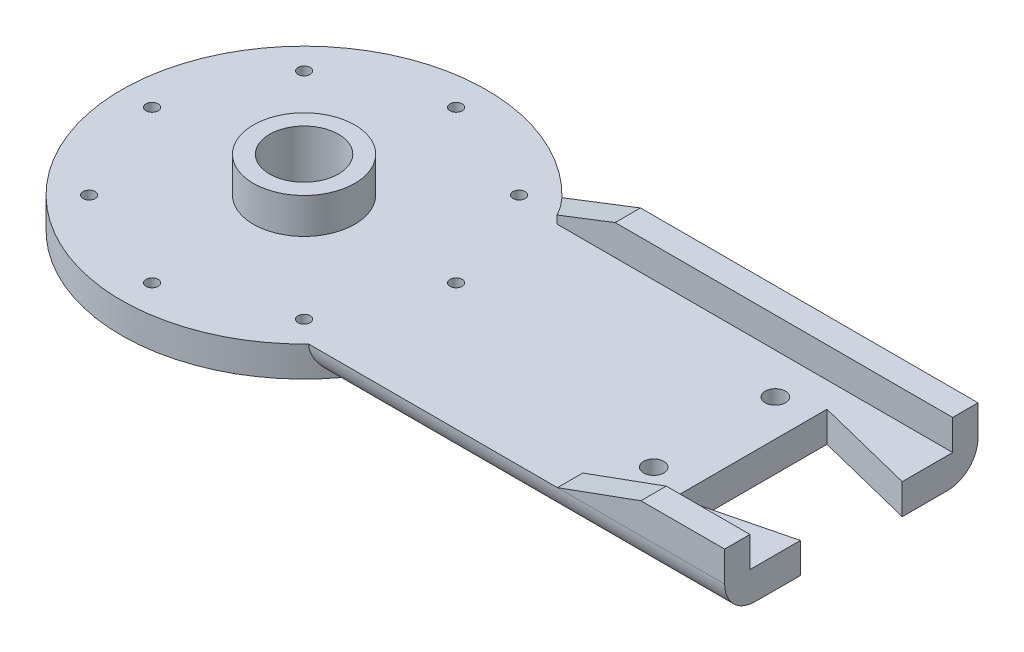
ISO-10303-21;
HEADER;
FILE_DESCRIPTION(('STEP AP214'),'2;1');
FILE_NAME('part.step','',(''),(''),'','','');
FILE_SCHEMA(('AUTOMOTIVE_DESIGN { 1 0 10303 214 1 1 1 1 }'));
ENDSEC;
DATA;
#1=APPLICATION_CONTEXT('core data for automotive mechanical design processes');
#2=APPLICATION_PROTOCOL_DEFINITION('international standard','automotive_design',2000,#1);
#3=PRODUCT_CONTEXT('',#1,'mechanical');
#4=PRODUCT('Part','Part','',(#3));
#5=PRODUCT_RELATED_PRODUCT_CATEGORY('part','',(#4));
#6=PRODUCT_DEFINITION_FORMATION('','',#4);
#7=PRODUCT_DEFINITION_CONTEXT('part definition',#1,'design');
#8=PRODUCT_DEFINITION('design','',#6,#7);
#9=PRODUCT_DEFINITION_SHAPE('','',#8);
#10=(LENGTH_UNIT() NAMED_UNIT(*) SI_UNIT(.MILLI.,.METRE.));
#11=(NAMED_UNIT(*) PLANE_ANGLE_UNIT() SI_UNIT($,.RADIAN.));
#12=(NAMED_UNIT(*) SI_UNIT($,.STERADIAN.) SOLID_ANGLE_UNIT());
#13=UNCERTAINTY_MEASURE_WITH_UNIT(LENGTH_MEASURE(1.E-05),#10,'distance_accuracy_value','');
#14=(GEOMETRIC_REPRESENTATION_CONTEXT(3) GLOBAL_UNCERTAINTY_ASSIGNED_CONTEXT((#13)) GLOBAL_UNIT_ASSIGNED_CONTEXT((#10,
#11,#12)) REPRESENTATION_CONTEXT('',''));
#15=CARTESIAN_POINT('',(0.,0.,0.));
#16=DIRECTION('',(0.,0.,1.));
#17=DIRECTION('',(1.,0.,0.));
#18=AXIS2_PLACEMENT_3D('',#15,#16,#17);
#19=CARTESIAN_POINT('',(-17.2583060351027,3.,-0.123865495102666));
#20=DIRECTION('',(0.,1.,0.));
#21=DIRECTION('',(0.,0.,1.));
#22=AXIS2_PLACEMENT_3D('',#19,#20,#21);
#23=PLANE('',#22);
#24=DIRECTION('',(0.,0.,1.));
#25=VECTOR('',#24,1.);
#26=CARTESIAN_POINT('',(20.2464685723943,3.,12.3719246819812));
#27=LINE('',#26,#25);
#28=CARTESIAN_POINT('',(20.2464685723943,3.,9.87192468198121));
#29=VERTEX_POINT('',#28);
#30=CARTESIAN_POINT('',(20.2464685723943,3.,12.3719246819812));
#31=VERTEX_POINT('',#30);
#32=EDGE_CURVE('E343',#29,#31,#27,.T.);
#33=ORIENTED_EDGE('',*,*,#32,.F.);
#34=DIRECTION('',(-1.,0.,0.));
#35=VECTOR('',#34,1.);
#36=CARTESIAN_POINT('',(36.7464685723943,3.,9.8719246819812));
#37=LINE('',#36,#35);
#38=CARTESIAN_POINT('',(36.7464685723943,3.,9.8719246819812));
#39=VERTEX_POINT('',#38);
#40=EDGE_CURVE('E352',#39,#29,#37,.T.);
#41=ORIENTED_EDGE('',*,*,#40,.F.);
#42=DIRECTION('',(0.,0.,-1.));
#43=VECTOR('',#42,1.);
#44=CARTESIAN_POINT('',(36.7464685723943,3.,4.8969247773482));
#45=LINE('',#44,#43);
#46=CARTESIAN_POINT('',(36.7464685723943,3.,4.8969247773482));
#47=VERTEX_POINT('',#46);
#48=EDGE_CURVE('E215',#39,#47,#45,.T.);
#49=ORIENTED_EDGE('',*,*,#48,.T.);
#50=DIRECTION('',(-0.970142511139978,0.,0.242535581057745));
#51=VECTOR('',#50,1.);
#52=CARTESIAN_POINT('',(36.7464685723943,3.,4.8969247773482));
#53=LINE('',#52,#51);
#54=CARTESIAN_POINT('',(26.8464670465143,3.,7.3719246819812));
#55=VERTEX_POINT('',#54);
#56=EDGE_CURVE('E223',#47,#55,#53,.T.);
#57=ORIENTED_EDGE('',*,*,#56,.T.);
#58=DIRECTION('',(0.,0.,-1.));
#59=VECTOR('',#58,1.);
#60=CARTESIAN_POINT('',(26.8464670465143,3.,7.3719246819812));
#61=LINE('',#60,#59);
#62=CARTESIAN_POINT('',(26.8464670465143,3.,-7.6280753180188));
#63=VERTEX_POINT('',#62);
#64=EDGE_CURVE('E226',#55,#63,#61,.T.);
#65=ORIENTED_EDGE('',*,*,#64,.T.);
#66=DIRECTION('',(0.970142511139978,0.,0.242535581057745));
#67=VECTOR('',#66,1.);
#68=CARTESIAN_POINT('',(26.8464670465143,3.,-7.6280753180188));
#69=LINE('',#68,#67);
#70=CARTESIAN_POINT('',(36.7464685723943,3.,-5.1530754133858));
#71=VERTEX_POINT('',#70);
#72=EDGE_CURVE('E217',#63,#71,#69,.T.);
#73=ORIENTED_EDGE('',*,*,#72,.T.);
#74=DIRECTION('',(0.,0.,-1.));
#75=VECTOR('',#74,1.);
#76=CARTESIAN_POINT('',(36.7464685723943,3.,-5.1530754133858));
#77=LINE('',#76,#75);
#78=CARTESIAN_POINT('',(36.7464685723943,3.,-10.1280753180188));
#79=VERTEX_POINT('',#78);
#80=EDGE_CURVE('E211',#71,#79,#77,.T.);
#81=ORIENTED_EDGE('',*,*,#80,.T.);
#82=DIRECTION('',(1.,0.,0.));
#83=VECTOR('',#82,1.);
#84=CARTESIAN_POINT('',(36.7464685723943,3.,-10.1280753180188));
#85=LINE('',#84,#83);
#86=CARTESIAN_POINT('',(-2.29241331476712,3.,-10.1280753180188));
#87=VERTEX_POINT('',#86);
#88=EDGE_CURVE('E203',#87,#79,#85,.T.);
#89=ORIENTED_EDGE('',*,*,#88,.F.);
#90=CARTESIAN_POINT('',(-17.2535313024667,3.,-0.128075480997254));
#91=DIRECTION('',(0.,-1.,0.));
#92=DIRECTION('',(0.,0.,1.));
#93=AXIS2_PLACEMENT_3D('',#90,#91,#92);
#94=CIRCLE('',#93,17.9954174217299);
#95=CARTESIAN_POINT('',(-4.30806675859033,3.,-12.6280753180188));
#96=VERTEX_POINT('',#95);
#97=EDGE_CURVE('E189',#96,#87,#94,.T.);
#98=ORIENTED_EDGE('',*,*,#97,.F.);
#99=CARTESIAN_POINT('',(-17.2583060351027,3.,-0.123865495102666));
#100=DIRECTION('',(0.,1.,0.));
#101=DIRECTION('',(0.,0.,1.));
#102=AXIS2_PLACEMENT_3D('',#99,#100,#101);
#103=CIRCLE('',#102,18.0017765960595);
#104=CARTESIAN_POINT('',(-4.29994238590957,3.,12.3719246819812));
#105=VERTEX_POINT('',#104);
#106=EDGE_CURVE('E200',#96,#105,#103,.T.);
#107=ORIENTED_EDGE('',*,*,#106,.T.);
#108=DIRECTION('',(1.,0.,0.));
#109=VECTOR('',#108,1.);
#110=CARTESIAN_POINT('',(36.7464685723943,3.,12.3719246819812));
#111=LINE('',#110,#109);
#112=EDGE_CURVE('E210',#105,#31,#111,.T.);
#113=ORIENTED_EDGE('',*,*,#112,.T.);
#114=EDGE_LOOP('',(#33,#41,#49,#57,#65,#73,#81,#89,#98,#107,#113));
#115=FACE_BOUND('',#114,.T.);
#116=CARTESIAN_POINT('',(-32.2535312150286,3.,-0.128075069628852));
#117=DIRECTION('',(0.,1.,0.));
#118=DIRECTION('',(0.,0.,1.));
#119=AXIS2_PLACEMENT_3D('',#116,#117,#118);
#120=CIRCLE('',#119,0.599999637650936);
#121=CARTESIAN_POINT('',(-32.2535312150286,3.,0.471924568022084));
#122=VERTEX_POINT('',#121);
#123=EDGE_CURVE('E392',#122,#122,#120,.T.);
#124=ORIENTED_EDGE('',*,*,#123,.F.);
#125=EDGE_LOOP('',(#124));
#126=FACE_BOUND('',#125,.T.);
#127=CARTESIAN_POINT('',(-17.2535311792144,3.,14.8719244694054));
#128=DIRECTION('',(0.,1.,0.));
#129=DIRECTION('',(0.,0.,1.));
#130=AXIS2_PLACEMENT_3D('',#127,#128,#129);
#131=CIRCLE('',#130,0.599999637649657);
#132=CARTESIAN_POINT('',(-17.2535311792144,3.,15.471924107055));
#133=VERTEX_POINT('',#132);
#134=EDGE_CURVE('E408',#133,#133,#131,.T.);
#135=ORIENTED_EDGE('',*,*,#134,.F.);
#136=EDGE_LOOP('',(#135));
#137=FACE_BOUND('',#136,.T.);
#138=CARTESIAN_POINT('',(-2.2535316401802,3.,-0.12807556640874));
#139=DIRECTION('',(0.,1.,0.));
#140=DIRECTION('',(0.,0.,1.));
#141=AXIS2_PLACEMENT_3D('',#138,#139,#140);
#142=CIRCLE('',#141,0.599999637648379);
#143=CARTESIAN_POINT('',(-2.2535316401802,3.,0.471924071239639));
#144=VERTEX_POINT('',#143);
#145=EDGE_CURVE('E424',#144,#144,#142,.T.);
#146=ORIENTED_EDGE('',*,*,#145,.F.);
#147=EDGE_LOOP('',(#146));
#148=FACE_BOUND('',#147,.T.);
#149=CARTESIAN_POINT('',(23.246467991517,3.,5.8719251235484));
#150=DIRECTION('',(0.,1.,0.));
#151=DIRECTION('',(0.,0.,1.));
#152=AXIS2_PLACEMENT_3D('',#149,#150,#151);
#153=CIRCLE('',#152,1.00000048556499);
#154=CARTESIAN_POINT('',(23.246467991517,3.,6.87192560911339));
#155=VERTEX_POINT('',#154);
#156=EDGE_CURVE('E440',#155,#155,#153,.T.);
#157=ORIENTED_EDGE('',*,*,#156,.F.);
#158=EDGE_LOOP('',(#157));
#159=FACE_BOUND('',#158,.T.);
#160=CARTESIAN_POINT('',(-17.2535316759943,3.,-15.128075105443));
#161=DIRECTION('',(0.,1.,0.));
#162=DIRECTION('',(0.,0.,1.));
#163=AXIS2_PLACEMENT_3D('',#160,#161,#162);
#164=CIRCLE('',#163,0.599999637649657);
#165=CARTESIAN_POINT('',(-17.2535316759943,3.,-14.5280754677933));
#166=VERTEX_POINT('',#165);
#167=EDGE_CURVE('E456',#166,#166,#164,.T.);
#168=ORIENTED_EDGE('',*,*,#167,.F.);
#169=EDGE_LOOP('',(#168));
#170=FACE_BOUND('',#169,.T.);
#171=CARTESIAN_POINT('',(23.2464678796688,3.,-6.12807509541241));
#172=DIRECTION('',(0.,1.,0.));
#173=DIRECTION('',(0.,0.,1.));
#174=AXIS2_PLACEMENT_3D('',#171,#172,#173);
#175=CIRCLE('',#174,0.999999892851165);
#176=CARTESIAN_POINT('',(23.2464678796688,3.,-5.12807520256125));
#177=VERTEX_POINT('',#176);
#178=EDGE_CURVE('E448',#177,#177,#175,.T.);
#179=ORIENTED_EDGE('',*,*,#178,.F.);
#180=EDGE_LOOP('',(#179));
#181=FACE_BOUND('',#180,.T.);
#182=CARTESIAN_POINT('',(-6.64693003575819,3.,-10.7346770611414));
#183=DIRECTION('',(0.,1.,0.));
#184=DIRECTION('',(0.,0.,1.));
#185=AXIS2_PLACEMENT_3D('',#182,#183,#184);
#186=CIRCLE('',#185,0.599999637648752);
#187=CARTESIAN_POINT('',(-6.64693003575819,3.,-10.1346774234927));
#188=VERTEX_POINT('',#187);
#189=EDGE_CURVE('E432',#188,#188,#186,.T.);
#190=ORIENTED_EDGE('',*,*,#189,.F.);
#191=EDGE_LOOP('',(#190));
#192=FACE_BOUND('',#191,.T.);
#193=CARTESIAN_POINT('',(-6.64692968448176,3.,10.4785260738274));
#194=DIRECTION('',(0.,1.,0.));
#195=DIRECTION('',(0.,0.,1.));
#196=AXIS2_PLACEMENT_3D('',#193,#194,#195);
#197=CIRCLE('',#196,0.599999637648757);
#198=CARTESIAN_POINT('',(-6.64692968448176,3.,11.0785257114762));
#199=VERTEX_POINT('',#198);
#200=EDGE_CURVE('E416',#199,#199,#197,.T.);
#201=ORIENTED_EDGE('',*,*,#200,.F.);
#202=EDGE_LOOP('',(#201));
#203=FACE_BOUND('',#202,.T.);
#204=CARTESIAN_POINT('',(-27.8601328194506,3.,10.4785264251038));
#205=DIRECTION('',(0.,1.,0.));
#206=DIRECTION('',(0.,0.,1.));
#207=AXIS2_PLACEMENT_3D('',#204,#205,#206);
#208=CIRCLE('',#207,0.599999637650558);
#209=CARTESIAN_POINT('',(-27.8601328194506,3.,11.0785260627544));
#210=VERTEX_POINT('',#209);
#211=EDGE_CURVE('E400',#210,#210,#208,.T.);
#212=ORIENTED_EDGE('',*,*,#211,.F.);
#213=EDGE_LOOP('',(#212));
#214=FACE_BOUND('',#213,.T.);
#215=CARTESIAN_POINT('',(-27.860133170727,3.,-10.734676709865));
#216=DIRECTION('',(0.,1.,0.));
#217=DIRECTION('',(0.,0.,1.));
#218=AXIS2_PLACEMENT_3D('',#215,#216,#217);
#219=CIRCLE('',#218,0.59999963765056);
#220=CARTESIAN_POINT('',(-27.860133170727,3.,-10.1346770722144));
#221=VERTEX_POINT('',#220);
#222=EDGE_CURVE('E384',#221,#221,#219,.T.);
#223=ORIENTED_EDGE('',*,*,#222,.F.);
#224=EDGE_LOOP('',(#223));
#225=FACE_BOUND('',#224,.T.);
#226=CARTESIAN_POINT('',(-17.2535313024667,3.,-0.128075480997254));
#227=DIRECTION('',(0.,1.,0.));
#228=DIRECTION('',(0.,0.,1.));
#229=AXIS2_PLACEMENT_3D('',#226,#227,#228);
#230=CIRCLE('',#229,5.);
#231=CARTESIAN_POINT('',(-17.2535313024667,3.,4.87192451900275));
#232=VERTEX_POINT('',#231);
#233=EDGE_CURVE('E586',#232,#232,#230,.T.);
#234=ORIENTED_EDGE('',*,*,#233,.F.);
#235=EDGE_LOOP('',(#234));
#236=FACE_BOUND('',#235,.T.);
#237=ADVANCED_FACE('F38',(#115,#126,#137,#148,#159,#170,#181,#192,#203,#214,#225,#236),#23,.T.);
#238=CARTESIAN_POINT('',(-17.2583060351027,0.,-0.123865495102666));
#239=DIRECTION('',(0.,1.,0.));
#240=DIRECTION('',(0.,0.,1.));
#241=AXIS2_PLACEMENT_3D('',#238,#239,#240);
#242=PLANE('',#241);
#243=CARTESIAN_POINT('',(-17.2583060351027,0.,-0.123865495102666));
#244=DIRECTION('',(0.,1.,0.));
#245=DIRECTION('',(0.,0.,1.));
#246=AXIS2_PLACEMENT_3D('',#243,#244,#245);
#247=CIRCLE('',#246,18.0017765960595);
#248=CARTESIAN_POINT('',(-1.96994587920566,0.,-9.62807531801879));
#249=VERTEX_POINT('',#248);
#250=CARTESIAN_POINT('',(-1.96471490916916,0.,9.37192468198121));
#251=VERTEX_POINT('',#250);
#252=EDGE_CURVE('E68',#249,#251,#247,.T.);
#253=ORIENTED_EDGE('',*,*,#252,.F.);
#254=DIRECTION('',(-1.,0.,0.));
#255=VECTOR('',#254,1.);
#256=CARTESIAN_POINT('',(-17.2583060351027,0.,-9.62807531801879));
#257=LINE('',#256,#255);
#258=CARTESIAN_POINT('',(36.7464685723943,0.,-9.6280753180188));
#259=VERTEX_POINT('',#258);
#260=EDGE_CURVE('E156',#249,#259,#257,.F.);
#261=ORIENTED_EDGE('',*,*,#260,.T.);
#262=DIRECTION('',(0.,0.,-1.));
#263=VECTOR('',#262,1.);
#264=CARTESIAN_POINT('',(36.7464685723943,0.,-5.1530754133858));
#265=LINE('',#264,#263);
#266=CARTESIAN_POINT('',(36.7464685723943,0.,-5.1530754133858));
#267=VERTEX_POINT('',#266);
#268=EDGE_CURVE('E234',#267,#259,#265,.T.);
#269=ORIENTED_EDGE('',*,*,#268,.F.);
#270=DIRECTION('',(0.970142511139978,0.,0.242535581057745));
#271=VECTOR('',#270,1.);
#272=CARTESIAN_POINT('',(26.8464670465143,0.,-7.6280753180188));
#273=LINE('',#272,#271);
#274=CARTESIAN_POINT('',(26.8464670465143,0.,-7.6280753180188));
#275=VERTEX_POINT('',#274);
#276=EDGE_CURVE('E230',#275,#267,#273,.T.);
#277=ORIENTED_EDGE('',*,*,#276,.F.);
#278=DIRECTION('',(0.,0.,-1.));
#279=VECTOR('',#278,1.);
#280=CARTESIAN_POINT('',(26.8464670465143,0.,7.3719246819812));
#281=LINE('',#280,#279);
#282=CARTESIAN_POINT('',(26.8464670465143,0.,7.3719246819812));
#283=VERTEX_POINT('',#282);
#284=EDGE_CURVE('E247',#283,#275,#281,.T.);
#285=ORIENTED_EDGE('',*,*,#284,.F.);
#286=DIRECTION('',(-0.970142511139978,0.,0.242535581057745));
#287=VECTOR('',#286,1.);
#288=CARTESIAN_POINT('',(36.7464685723943,0.,4.8969247773482));
#289=LINE('',#288,#287);
#290=CARTESIAN_POINT('',(36.7464685723943,0.,4.8969247773482));
#291=VERTEX_POINT('',#290);
#292=EDGE_CURVE('E244',#291,#283,#289,.T.);
#293=ORIENTED_EDGE('',*,*,#292,.F.);
#294=DIRECTION('',(0.,0.,-1.));
#295=VECTOR('',#294,1.);
#296=CARTESIAN_POINT('',(36.7464685723943,0.,4.8969247773482));
#297=LINE('',#296,#295);
#298=CARTESIAN_POINT('',(36.7464685723943,0.,9.3719246819812));
#299=VERTEX_POINT('',#298);
#300=EDGE_CURVE('E241',#299,#291,#297,.T.);
#301=ORIENTED_EDGE('',*,*,#300,.F.);
#302=DIRECTION('',(1.,0.,0.));
#303=VECTOR('',#302,1.);
#304=CARTESIAN_POINT('',(-17.2583060351027,0.,9.37192468198121));
#305=LINE('',#304,#303);
#306=EDGE_CURVE('E171',#299,#251,#305,.F.);
#307=ORIENTED_EDGE('',*,*,#306,.T.);
#308=EDGE_LOOP('',(#253,#261,#269,#277,#285,#293,#301,#307));
#309=FACE_BOUND('',#308,.T.);
#310=CARTESIAN_POINT('',(-17.2535313024667,0.,-0.128075480997254));
#311=DIRECTION('',(0.,1.,0.));
#312=DIRECTION('',(0.,0.,1.));
#313=AXIS2_PLACEMENT_3D('',#310,#311,#312);
#314=CIRCLE('',#313,3.3999998684916);
#315=CARTESIAN_POINT('',(-17.2535313024667,0.,3.27192438749435));
#316=VERTEX_POINT('',#315);
#317=EDGE_CURVE('E235',#316,#316,#314,.T.);
#318=ORIENTED_EDGE('',*,*,#317,.T.);
#319=EDGE_LOOP('',(#318));
#320=FACE_BOUND('',#319,.T.);
#321=CARTESIAN_POINT('',(-17.2535316759943,0.,-15.128075105443));
#322=DIRECTION('',(0.,1.,0.));
#323=DIRECTION('',(0.,0.,1.));
#324=AXIS2_PLACEMENT_3D('',#321,#322,#323);
#325=CIRCLE('',#324,0.599999637649657);
#326=CARTESIAN_POINT('',(-17.2535316759943,0.,-14.5280754677933));
#327=VERTEX_POINT('',#326);
#328=EDGE_CURVE('E452',#327,#327,#325,.T.);
#329=ORIENTED_EDGE('',*,*,#328,.T.);
#330=EDGE_LOOP('',(#329));
#331=FACE_BOUND('',#330,.T.);
#332=CARTESIAN_POINT('',(23.2464678796688,0.,-6.12807509541241));
#333=DIRECTION('',(0.,1.,0.));
#334=DIRECTION('',(0.,0.,1.));
#335=AXIS2_PLACEMENT_3D('',#332,#333,#334);
#336=CIRCLE('',#335,0.999999892851165);
#337=CARTESIAN_POINT('',(23.2464678796688,0.,-5.12807520256125));
#338=VERTEX_POINT('',#337);
#339=EDGE_CURVE('E444',#338,#338,#336,.T.);
#340=ORIENTED_EDGE('',*,*,#339,.T.);
#341=EDGE_LOOP('',(#340));
#342=FACE_BOUND('',#341,.T.);
#343=CARTESIAN_POINT('',(23.246467991517,0.,5.8719251235484));
#344=DIRECTION('',(0.,1.,0.));
#345=DIRECTION('',(0.,0.,1.));
#346=AXIS2_PLACEMENT_3D('',#343,#344,#345);
#347=CIRCLE('',#346,1.00000048556499);
#348=CARTESIAN_POINT('',(23.246467991517,0.,6.87192560911339));
#349=VERTEX_POINT('',#348);
#350=EDGE_CURVE('E436',#349,#349,#347,.T.);
#351=ORIENTED_EDGE('',*,*,#350,.T.);
#352=EDGE_LOOP('',(#351));
#353=FACE_BOUND('',#352,.T.);
#354=CARTESIAN_POINT('',(-6.64693003575819,0.,-10.7346770611414));
#355=DIRECTION('',(0.,1.,0.));
#356=DIRECTION('',(0.,0.,1.));
#357=AXIS2_PLACEMENT_3D('',#354,#355,#356);
#358=CIRCLE('',#357,0.599999637648752);
#359=CARTESIAN_POINT('',(-6.64693003575819,0.,-10.1346774234927));
#360=VERTEX_POINT('',#359);
#361=EDGE_CURVE('E428',#360,#360,#358,.T.);
#362=ORIENTED_EDGE('',*,*,#361,.T.);
#363=EDGE_LOOP('',(#362));
#364=FACE_BOUND('',#363,.T.);
#365=CARTESIAN_POINT('',(-2.2535316401802,0.,-0.12807556640874));
#366=DIRECTION('',(0.,1.,0.));
#367=DIRECTION('',(0.,0.,1.));
#368=AXIS2_PLACEMENT_3D('',#365,#366,#367);
#369=CIRCLE('',#368,0.599999637648379);
#370=CARTESIAN_POINT('',(-2.2535316401802,0.,0.471924071239639));
#371=VERTEX_POINT('',#370);
#372=EDGE_CURVE('E420',#371,#371,#369,.T.);
#373=ORIENTED_EDGE('',*,*,#372,.T.);
#374=EDGE_LOOP('',(#373));
#375=FACE_BOUND('',#374,.T.);
#376=CARTESIAN_POINT('',(-6.64692968448176,0.,10.4785260738274));
#377=DIRECTION('',(0.,1.,0.));
#378=DIRECTION('',(0.,0.,1.));
#379=AXIS2_PLACEMENT_3D('',#376,#377,#378);
#380=CIRCLE('',#379,0.599999637648757);
#381=CARTESIAN_POINT('',(-6.64692968448176,0.,11.0785257114762));
#382=VERTEX_POINT('',#381);
#383=EDGE_CURVE('E412',#382,#382,#380,.T.);
#384=ORIENTED_EDGE('',*,*,#383,.T.);
#385=EDGE_LOOP('',(#384));
#386=FACE_BOUND('',#385,.T.);
#387=CARTESIAN_POINT('',(-17.2535311792144,0.,14.8719244694054));
#388=DIRECTION('',(0.,1.,0.));
#389=DIRECTION('',(0.,0.,1.));
#390=AXIS2_PLACEMENT_3D('',#387,#388,#389);
#391=CIRCLE('',#390,0.599999637649657);
#392=CARTESIAN_POINT('',(-17.2535311792144,0.,15.471924107055));
#393=VERTEX_POINT('',#392);
#394=EDGE_CURVE('E404',#393,#393,#391,.T.);
#395=ORIENTED_EDGE('',*,*,#394,.T.);
#396=EDGE_LOOP('',(#395));
#397=FACE_BOUND('',#396,.T.);
#398=CARTESIAN_POINT('',(-27.8601328194506,0.,10.4785264251038));
#399=DIRECTION('',(0.,1.,0.));
#400=DIRECTION('',(0.,0.,1.));
#401=AXIS2_PLACEMENT_3D('',#398,#399,#400);
#402=CIRCLE('',#401,0.599999637650558);
#403=CARTESIAN_POINT('',(-27.8601328194506,0.,11.0785260627544));
#404=VERTEX_POINT('',#403);
#405=EDGE_CURVE('E396',#404,#404,#402,.T.);
#406=ORIENTED_EDGE('',*,*,#405,.T.);
#407=EDGE_LOOP('',(#406));
#408=FACE_BOUND('',#407,.T.);
#409=CARTESIAN_POINT('',(-32.2535312150286,0.,-0.128075069628852));
#410=DIRECTION('',(0.,1.,0.));
#411=DIRECTION('',(0.,0.,1.));
#412=AXIS2_PLACEMENT_3D('',#409,#410,#411);
#413=CIRCLE('',#412,0.599999637650936);
#414=CARTESIAN_POINT('',(-32.2535312150286,0.,0.471924568022084));
#415=VERTEX_POINT('',#414);
#416=EDGE_CURVE('E388',#415,#415,#413,.T.);
#417=ORIENTED_EDGE('',*,*,#416,.T.);
#418=EDGE_LOOP('',(#417));
#419=FACE_BOUND('',#418,.T.);
#420=CARTESIAN_POINT('',(-27.860133170727,0.,-10.734676709865));
#421=DIRECTION('',(0.,1.,0.));
#422=DIRECTION('',(0.,0.,1.));
#423=AXIS2_PLACEMENT_3D('',#420,#421,#422);
#424=CIRCLE('',#423,0.59999963765056);
#425=CARTESIAN_POINT('',(-27.860133170727,0.,-10.1346770722144));
#426=VERTEX_POINT('',#425);
#427=EDGE_CURVE('E383',#426,#426,#424,.T.);
#428=ORIENTED_EDGE('',*,*,#427,.T.);
#429=EDGE_LOOP('',(#428));
#430=FACE_BOUND('',#429,.T.);
#431=ADVANCED_FACE('F300',(#309,#320,#331,#342,#353,#364,#375,#386,#397,#408,#419,#430),#242,.F.);
#432=CARTESIAN_POINT('',(26.8464670465143,3.,-7.6280753180188));
#433=DIRECTION('',(0.242535581057745,0.,-0.970142511139978));
#434=DIRECTION('',(-0.970142511139978,0.,-0.242535581057745));
#435=AXIS2_PLACEMENT_3D('',#432,#433,#434);
#436=PLANE('',#435);
#437=ORIENTED_EDGE('',*,*,#276,.T.);
#438=DIRECTION('',(0.,-1.,0.));
#439=VECTOR('',#438,1.);
#440=CARTESIAN_POINT('',(36.7464685723943,3.,-5.1530754133858));
#441=LINE('',#440,#439);
#442=EDGE_CURVE('E266',#71,#267,#441,.T.);
#443=ORIENTED_EDGE('',*,*,#442,.F.);
#444=ORIENTED_EDGE('',*,*,#72,.F.);
#445=DIRECTION('',(0.,-1.,0.));
#446=VECTOR('',#445,1.);
#447=CARTESIAN_POINT('',(26.8464670465143,3.,-7.6280753180188));
#448=LINE('',#447,#446);
#449=EDGE_CURVE('E229',#63,#275,#448,.T.);
#450=ORIENTED_EDGE('',*,*,#449,.T.);
#451=EDGE_LOOP('',(#437,#443,#444,#450));
#452=FACE_BOUND('',#451,.T.);
#453=ADVANCED_FACE('F296',(#452),#436,.F.);
#454=CARTESIAN_POINT('',(36.7464685723943,3.,-5.1530754133858));
#455=DIRECTION('',(-1.,0.,0.));
#456=DIRECTION('',(0.,0.,1.));
#457=AXIS2_PLACEMENT_3D('',#454,#455,#456);
#458=PLANE('',#457);
#459=ORIENTED_EDGE('',*,*,#268,.T.);
#460=CARTESIAN_POINT('',(36.7464685723943,3.,-9.6280753180188));
#461=DIRECTION('',(-1.,0.,0.));
#462=DIRECTION('',(0.,0.,1.));
#463=AXIS2_PLACEMENT_3D('',#460,#461,#462);
#464=CIRCLE('',#463,3.);
#465=CARTESIAN_POINT('',(36.7464685723943,3.,-12.6280753180188));
#466=VERTEX_POINT('',#465);
#467=EDGE_CURVE('E279',#259,#466,#464,.F.);
#468=ORIENTED_EDGE('',*,*,#467,.T.);
#469=DIRECTION('',(0.,-1.,0.));
#470=VECTOR('',#469,1.);
#471=CARTESIAN_POINT('',(36.7464685723943,3.,-12.6280753180188));
#472=LINE('',#471,#470);
#473=CARTESIAN_POINT('',(36.7464685723943,6.,-12.6280753180188));
#474=VERTEX_POINT('',#473);
#475=EDGE_CURVE('E169',#474,#466,#472,.T.);
#476=ORIENTED_EDGE('',*,*,#475,.F.);
#477=DIRECTION('',(0.,0.,-1.));
#478=VECTOR('',#477,1.);
#479=CARTESIAN_POINT('',(36.7464685723943,6.,-12.6280753180188));
#480=LINE('',#479,#478);
#481=CARTESIAN_POINT('',(36.7464685723943,6.,-10.1280753180188));
#482=VERTEX_POINT('',#481);
#483=EDGE_CURVE('E365',#482,#474,#480,.T.);
#484=ORIENTED_EDGE('',*,*,#483,.F.);
#485=DIRECTION('',(0.,-1.,0.));
#486=VECTOR('',#485,1.);
#487=CARTESIAN_POINT('',(36.7464685723943,6.,-10.1280753180188));
#488=LINE('',#487,#486);
#489=EDGE_CURVE('E374',#482,#79,#488,.T.);
#490=ORIENTED_EDGE('',*,*,#489,.T.);
#491=ORIENTED_EDGE('',*,*,#80,.F.);
#492=ORIENTED_EDGE('',*,*,#442,.T.);
#493=EDGE_LOOP('',(#459,#468,#476,#484,#490,#491,#492));
#494=FACE_BOUND('',#493,.T.);
#495=ADVANCED_FACE('F299',(#494),#458,.F.);
#496=CARTESIAN_POINT('',(36.7464685723943,3.,-12.6280753180188));
#497=DIRECTION('',(0.,0.,1.));
#498=DIRECTION('',(1.,0.,0.));
#499=AXIS2_PLACEMENT_3D('',#496,#497,#498);
#500=PLANE('',#499);
#501=ORIENTED_EDGE('',*,*,#475,.T.);
#502=DIRECTION('',(-1.,0.,0.));
#503=VECTOR('',#502,1.);
#504=CARTESIAN_POINT('',(36.7464685723943,3.,-12.6280753180188));
#505=LINE('',#504,#503);
#506=EDGE_CURVE('E155',#466,#96,#505,.T.);
#507=ORIENTED_EDGE('',*,*,#506,.T.);
#508=DIRECTION('',(-0.93256809827409,-0.360994102557712,0.));
#509=VECTOR('',#508,1.);
#510=CARTESIAN_POINT('',(3.44193324140967,6.,-12.6280753180188));
#511=LINE('',#510,#509);
#512=CARTESIAN_POINT('',(3.44193324140967,6.,-12.6280753180188));
#513=VERTEX_POINT('',#512);
#514=EDGE_CURVE('E167',#513,#96,#511,.T.);
#515=ORIENTED_EDGE('',*,*,#514,.F.);
#516=DIRECTION('',(-1.,0.,0.));
#517=VECTOR('',#516,1.);
#518=CARTESIAN_POINT('',(36.7464685723943,6.,-12.6280753180188));
#519=LINE('',#518,#517);
#520=EDGE_CURVE('E369',#474,#513,#519,.T.);
#521=ORIENTED_EDGE('',*,*,#520,.F.);
#522=EDGE_LOOP('',(#501,#507,#515,#521));
#523=FACE_BOUND('',#522,.T.);
#524=ADVANCED_FACE('F165',(#523),#500,.F.);
#525=CARTESIAN_POINT('',(-17.2583060351027,3.,-0.123865495102666));
#526=DIRECTION('',(0.,-1.,0.));
#527=DIRECTION('',(0.,0.,-1.));
#528=AXIS2_PLACEMENT_3D('',#525,#526,#527);
#529=CYLINDRICAL_SURFACE('',#528,18.0017765960595);
#530=ORIENTED_EDGE('',*,*,#252,.T.);
#531=CARTESIAN_POINT('',(-1.96471490916916,0.,9.37192468198121));
#532=CARTESIAN_POINT('',(-2.03203273141902,7.67308940528366E-06,9.48037126532188));
#533=CARTESIAN_POINT('',(-2.10050593710106,0.00587940418370087,9.5880520871795));
#534=CARTESIAN_POINT('',(-2.23912485163159,0.0289186042511127,9.80106094814871));
#535=CARTESIAN_POINT('',(-2.30927001800785,0.0460824562779905,9.90638972946965));
#536=CARTESIAN_POINT('',(-2.45085317050553,0.0913427047292675,10.1142588951841));
#537=CARTESIAN_POINT('',(-2.5222944361857,0.119472147980085,10.2167898387808));
#538=CARTESIAN_POINT('',(-2.66557392161784,0.186297673532378,10.4180229507368));
#539=CARTESIAN_POINT('',(-2.73741215547101,0.224994133592774,10.5167249820726));
#540=CARTESIAN_POINT('',(-2.94365382708536,0.351125413205727,10.7942551286191));
#541=CARTESIAN_POINT('',(-3.07777285341519,0.451570956259856,10.967584036238));
#542=CARTESIAN_POINT('',(-3.33918308318025,0.687751847088992,11.2939090352711));
#543=CARTESIAN_POINT('',(-3.46648466359902,0.823431609571929,11.4469365845695));
#544=CARTESIAN_POINT('',(-3.67261474769662,1.08690800209931,11.6875959200176));
#545=CARTESIAN_POINT('',(-3.75500473722055,1.20618391986869,11.7815139251442));
#546=CARTESIAN_POINT('',(-3.90798375924805,1.46286899657066,11.952805532592));
#547=CARTESIAN_POINT('',(-3.97859045742367,1.60025044778128,12.0302039507963));
#548=CARTESIAN_POINT('',(-4.08993231859083,1.86197784852294,12.1506291123592));
#549=CARTESIAN_POINT('',(-4.13382384819414,1.98322503090359,12.1974492333649));
#550=CARTESIAN_POINT('',(-4.20762339088824,2.23454075004901,12.2755921837279));
#551=CARTESIAN_POINT('',(-4.23756411478205,2.36458782437268,12.3069512750957));
#552=CARTESIAN_POINT('',(-4.27257549899871,2.57961846923091,12.3434976975679));
#553=CARTESIAN_POINT('',(-4.28277552425588,2.66289094194148,12.3541044587423));
#554=CARTESIAN_POINT('',(-4.29648560620965,2.83075013664123,12.3683401290386));
#555=CARTESIAN_POINT('',(-4.29998130778462,2.91533928861365,12.3719540654549));
#556=CARTESIAN_POINT('',(-4.29994238590957,3.,12.3719246819812));
#557=B_SPLINE_CURVE_WITH_KNOTS('',3,(#531,#532,#533,#534,#535,#536,#537,#538,#539,#540,#541,
#542,#543,#544,#545,#546,#547,#548,#549,#550,#551,#552,#553,#554,#555,#556),.UNSPECIFIED.,.F.,
.F.,(4,2,2,2,2,2,2,2,2,2,2,2,4),(0.,0.382721641513899,0.765320754222535,1.14908192635242,
1.53285681930737,2.25260370410725,2.97122194654046,3.48767251283912,4.00334171497274,
4.41332744886649,4.82234698054904,5.07551092542721,5.32921633574163),.UNSPECIFIED.);
#558=EDGE_CURVE('E11',#251,#105,#557,.T.);
#559=ORIENTED_EDGE('',*,*,#558,.T.);
#560=ORIENTED_EDGE('',*,*,#106,.F.);
#561=CARTESIAN_POINT('',(-4.30806675859033,3.,-12.6280753180188));
#562=CARTESIAN_POINT('',(-4.30808893827682,2.93075715989679,-12.6280929172565));
#563=CARTESIAN_POINT('',(-4.30575276978215,2.86153010229841,-12.6256786878097));
#564=CARTESIAN_POINT('',(-4.29653414875035,2.72377036417578,-12.6161234878429));
#565=CARTESIAN_POINT('',(-4.28965592602771,2.65523709778643,-12.60898691502));
#566=CARTESIAN_POINT('',(-4.27160770122397,2.52003105903657,-12.59021156466));
#567=CARTESIAN_POINT('',(-4.26047838045377,2.45334688871898,-12.5786154561525));
#568=CARTESIAN_POINT('',(-4.23422229643905,2.32167520471655,-12.5511566463105));
#569=CARTESIAN_POINT('',(-4.21909481092841,2.25668799992066,-12.53529317407));
#570=CARTESIAN_POINT('',(-4.16834509225967,2.06537000792964,-12.4818303010143));
#571=CARTESIAN_POINT('',(-4.12727012002175,1.9420785328213,-12.4382709755422));
#572=CARTESIAN_POINT('',(-4.03355830965936,1.70570030982478,-12.3375767613683));
#573=CARTESIAN_POINT('',(-3.98088999233264,1.59264255224064,-12.2804048755194));
#574=CARTESIAN_POINT('',(-3.84250847413755,1.33181579730209,-12.1278196973399));
#575=CARTESIAN_POINT('',(-3.75229503862674,1.18987486688277,-12.0265076011313));
#576=CARTESIAN_POINT('',(-3.56090796830601,0.929512855759363,-11.8057602294508));
#577=CARTESIAN_POINT('',(-3.45971868747528,0.811126050682658,-11.6862989826919));
#578=CARTESIAN_POINT('',(-3.2489888199163,0.595570142261624,-11.4301070689937));
#579=CARTESIAN_POINT('',(-3.13931633528629,0.49890619094219,-11.2930629918628));
#580=CARTESIAN_POINT('',(-2.91736987530172,0.33031746320375,-11.00661717711));
#581=CARTESIAN_POINT('',(-2.80509777758644,0.258375391220957,-10.8572241700123));
#582=CARTESIAN_POINT('',(-2.63151468365214,0.166663255558726,-10.6182426260046));
#583=CARTESIAN_POINT('',(-2.57005550457707,0.137996456989775,-10.5320674955798));
#584=CARTESIAN_POINT('',(-2.44764010576589,0.0885135087671496,-10.3571210534424));
#585=CARTESIAN_POINT('',(-2.38668387517408,0.0676971892318013,-10.268349797954));
#586=CARTESIAN_POINT('',(-2.2656368947548,0.0341436600533844,-10.0885817623742));
#587=CARTESIAN_POINT('',(-2.20554705970571,0.0214144543840169,-9.99758286974112));
#588=CARTESIAN_POINT('',(-2.08666883720568,0.00434347375896072,-9.81393401316683));
#589=CARTESIAN_POINT('',(-2.0278807772627,3.78630923919806E-06,-9.72128364408638));
#590=CARTESIAN_POINT('',(-1.96994587920566,0.,-9.62807531801879));
#591=B_SPLINE_CURVE_WITH_KNOTS('',3,(#561,#562,#563,#564,#565,#566,#567,#568,#569,#570,#571,
#572,#573,#574,#575,#576,#577,#578,#579,#580,#581,#582,#583,#584,#585,#586,#587,#588,#589,#590),
.UNSPECIFIED.,.F.,.F.,(4,2,2,2,2,2,2,2,2,2,2,2,2,2,4),(0.,0.207621477469471,0.415049878380994,
0.620541082646842,0.826069434181759,1.23530106653281,1.64565789456103,2.2314761092468,
2.81814066156214,3.41729008889474,4.01601949049025,4.34473363169464,4.67344065922954,
5.00247250976046,5.33158622048559),.UNSPECIFIED.);
#592=EDGE_CURVE('E53',#96,#249,#591,.T.);
#593=ORIENTED_EDGE('',*,*,#592,.T.);
#594=EDGE_LOOP('',(#530,#559,#560,#593));
#595=FACE_BOUND('',#594,.T.);
#596=ADVANCED_FACE('F207',(#595),#529,.T.);
#597=CARTESIAN_POINT('',(36.7464685723943,3.,12.3719246819812));
#598=DIRECTION('',(0.,0.,-1.));
#599=DIRECTION('',(-1.,0.,0.));
#600=AXIS2_PLACEMENT_3D('',#597,#598,#599);
#601=PLANE('',#600);
#602=DIRECTION('',(0.939660170892443,0.342109285519093,0.));
#603=VECTOR('',#602,1.);
#604=CARTESIAN_POINT('',(20.2464685723943,3.,12.3719246819812));
#605=LINE('',#604,#603);
#606=CARTESIAN_POINT('',(28.4864685723943,6.,12.3719246819812));
#607=VERTEX_POINT('',#606);
#608=EDGE_CURVE('E192',#31,#607,#605,.T.);
#609=ORIENTED_EDGE('',*,*,#608,.F.);
#610=DIRECTION('',(1.,0.,0.));
#611=VECTOR('',#610,1.);
#612=CARTESIAN_POINT('',(36.7464685723943,3.,12.3719246819812));
#613=LINE('',#612,#611);
#614=CARTESIAN_POINT('',(36.7464685723943,3.,12.3719246819812));
#615=VERTEX_POINT('',#614);
#616=EDGE_CURVE('E60',#31,#615,#613,.T.);
#617=ORIENTED_EDGE('',*,*,#616,.T.);
#618=DIRECTION('',(0.,-1.,0.));
#619=VECTOR('',#618,1.);
#620=CARTESIAN_POINT('',(36.7464685723943,3.,12.3719246819812));
#621=LINE('',#620,#619);
#622=CARTESIAN_POINT('',(36.7464685723943,6.,12.3719246819812));
#623=VERTEX_POINT('',#622);
#624=EDGE_CURVE('E261',#623,#615,#621,.T.);
#625=ORIENTED_EDGE('',*,*,#624,.F.);
#626=DIRECTION('',(1.,0.,0.));
#627=VECTOR('',#626,1.);
#628=CARTESIAN_POINT('',(36.7464685723943,6.,12.3719246819812));
#629=LINE('',#628,#627);
#630=EDGE_CURVE('E335',#607,#623,#629,.T.);
#631=ORIENTED_EDGE('',*,*,#630,.F.);
#632=EDGE_LOOP('',(#609,#617,#625,#631));
#633=FACE_BOUND('',#632,.T.);
#634=ADVANCED_FACE('F308',(#633),#601,.F.);
#635=CARTESIAN_POINT('',(36.7464685723943,3.,4.8969247773482));
#636=DIRECTION('',(-1.,0.,0.));
#637=DIRECTION('',(0.,0.,1.));
#638=AXIS2_PLACEMENT_3D('',#635,#636,#637);
#639=PLANE('',#638);
#640=ORIENTED_EDGE('',*,*,#624,.T.);
#641=CARTESIAN_POINT('',(36.7464685723943,3.,9.3719246819812));
#642=DIRECTION('',(-1.,0.,0.));
#643=DIRECTION('',(0.,0.,1.));
#644=AXIS2_PLACEMENT_3D('',#641,#642,#643);
#645=CIRCLE('',#644,3.);
#646=EDGE_CURVE('E160',#615,#299,#645,.F.);
#647=ORIENTED_EDGE('',*,*,#646,.T.);
#648=ORIENTED_EDGE('',*,*,#300,.T.);
#649=DIRECTION('',(0.,-1.,0.));
#650=VECTOR('',#649,1.);
#651=CARTESIAN_POINT('',(36.7464685723943,3.,4.8969247773482));
#652=LINE('',#651,#650);
#653=EDGE_CURVE('E257',#47,#291,#652,.T.);
#654=ORIENTED_EDGE('',*,*,#653,.F.);
#655=ORIENTED_EDGE('',*,*,#48,.F.);
#656=DIRECTION('',(0.,-1.,0.));
#657=VECTOR('',#656,1.);
#658=CARTESIAN_POINT('',(36.7464685723943,6.,9.8719246819812));
#659=LINE('',#658,#657);
#660=CARTESIAN_POINT('',(36.7464685723943,6.,9.8719246819812));
#661=VERTEX_POINT('',#660);
#662=EDGE_CURVE('E205',#661,#39,#659,.T.);
#663=ORIENTED_EDGE('',*,*,#662,.F.);
#664=DIRECTION('',(0.,0.,-1.));
#665=VECTOR('',#664,1.);
#666=CARTESIAN_POINT('',(36.7464685723943,6.,12.3719246819812));
#667=LINE('',#666,#665);
#668=EDGE_CURVE('E351',#623,#661,#667,.T.);
#669=ORIENTED_EDGE('',*,*,#668,.F.);
#670=EDGE_LOOP('',(#640,#647,#648,#654,#655,#663,#669));
#671=FACE_BOUND('',#670,.T.);
#672=ADVANCED_FACE('F327',(#671),#639,.F.);
#673=CARTESIAN_POINT('',(36.7464685723943,3.,4.8969247773482));
#674=DIRECTION('',(0.242535581057745,0.,0.970142511139978));
#675=DIRECTION('',(0.970142511139978,0.,-0.242535581057745));
#676=AXIS2_PLACEMENT_3D('',#673,#674,#675);
#677=PLANE('',#676);
#678=ORIENTED_EDGE('',*,*,#292,.T.);
#679=DIRECTION('',(0.,-1.,0.));
#680=VECTOR('',#679,1.);
#681=CARTESIAN_POINT('',(26.8464670465143,3.,7.3719246819812));
#682=LINE('',#681,#680);
#683=EDGE_CURVE('E253',#55,#283,#682,.T.);
#684=ORIENTED_EDGE('',*,*,#683,.F.);
#685=ORIENTED_EDGE('',*,*,#56,.F.);
#686=ORIENTED_EDGE('',*,*,#653,.T.);
#687=EDGE_LOOP('',(#678,#684,#685,#686));
#688=FACE_BOUND('',#687,.T.);
#689=ADVANCED_FACE('F323',(#688),#677,.F.);
#690=CARTESIAN_POINT('',(26.8464670465143,3.,7.3719246819812));
#691=DIRECTION('',(-1.,0.,0.));
#692=DIRECTION('',(0.,0.,1.));
#693=AXIS2_PLACEMENT_3D('',#690,#691,#692);
#694=PLANE('',#693);
#695=ORIENTED_EDGE('',*,*,#284,.T.);
#696=ORIENTED_EDGE('',*,*,#449,.F.);
#697=ORIENTED_EDGE('',*,*,#64,.F.);
#698=ORIENTED_EDGE('',*,*,#683,.T.);
#699=EDGE_LOOP('',(#695,#696,#697,#698));
#700=FACE_BOUND('',#699,.T.);
#701=ADVANCED_FACE('F320',(#700),#694,.F.);
#702=CARTESIAN_POINT('',(-17.2535313024667,3.,-0.128075480997254));
#703=DIRECTION('',(0.,-1.,0.));
#704=DIRECTION('',(0.,0.,-1.));
#705=AXIS2_PLACEMENT_3D('',#702,#703,#704);
#706=CYLINDRICAL_SURFACE('',#705,3.3999998684916);
#707=ORIENTED_EDGE('',*,*,#317,.F.);
#708=EDGE_LOOP('',(#707));
#709=FACE_BOUND('',#708,.T.);
#710=CARTESIAN_POINT('',(-17.2535313024667,6.5,-0.128075480997254));
#711=DIRECTION('',(0.,1.,0.));
#712=DIRECTION('',(0.,0.,1.));
#713=AXIS2_PLACEMENT_3D('',#710,#711,#712);
#714=CIRCLE('',#713,3.3999998684916);
#715=CARTESIAN_POINT('',(-17.2535313024667,6.5,3.27192438749435));
#716=VERTEX_POINT('',#715);
#717=EDGE_CURVE('E589',#716,#716,#714,.T.);
#718=ORIENTED_EDGE('',*,*,#717,.T.);
#719=EDGE_LOOP('',(#718));
#720=FACE_BOUND('',#719,.T.);
#721=ADVANCED_FACE('F317',(#709,#720),#706,.F.);
#722=CARTESIAN_POINT('',(-17.2535316759943,3.,-15.128075105443));
#723=DIRECTION('',(0.,-1.,0.));
#724=DIRECTION('',(0.,0.,-1.));
#725=AXIS2_PLACEMENT_3D('',#722,#723,#724);
#726=CYLINDRICAL_SURFACE('',#725,0.599999637649657);
#727=ORIENTED_EDGE('',*,*,#167,.T.);
#728=EDGE_LOOP('',(#727));
#729=FACE_BOUND('',#728,.T.);
#730=ORIENTED_EDGE('',*,*,#328,.F.);
#731=EDGE_LOOP('',(#730));
#732=FACE_BOUND('',#731,.T.);
#733=ADVANCED_FACE('F562',(#729,#732),#726,.F.);
#734=CARTESIAN_POINT('',(23.2464678796688,3.,-6.12807509541241));
#735=DIRECTION('',(0.,-1.,0.));
#736=DIRECTION('',(0.,0.,-1.));
#737=AXIS2_PLACEMENT_3D('',#734,#735,#736);
#738=CYLINDRICAL_SURFACE('',#737,0.999999892851165);
#739=ORIENTED_EDGE('',*,*,#178,.T.);
#740=EDGE_LOOP('',(#739));
#741=FACE_BOUND('',#740,.T.);
#742=ORIENTED_EDGE('',*,*,#339,.F.);
#743=EDGE_LOOP('',(#742));
#744=FACE_BOUND('',#743,.T.);
#745=ADVANCED_FACE('F559',(#741,#744),#738,.F.);
#746=CARTESIAN_POINT('',(23.246467991517,3.,5.8719251235484));
#747=DIRECTION('',(0.,-1.,0.));
#748=DIRECTION('',(0.,0.,-1.));
#749=AXIS2_PLACEMENT_3D('',#746,#747,#748);
#750=CYLINDRICAL_SURFACE('',#749,1.00000048556499);
#751=ORIENTED_EDGE('',*,*,#156,.T.);
#752=EDGE_LOOP('',(#751));
#753=FACE_BOUND('',#752,.T.);
#754=ORIENTED_EDGE('',*,*,#350,.F.);
#755=EDGE_LOOP('',(#754));
#756=FACE_BOUND('',#755,.T.);
#757=ADVANCED_FACE('F555',(#753,#756),#750,.F.);
#758=CARTESIAN_POINT('',(-6.64693003575819,3.,-10.7346770611414));
#759=DIRECTION('',(0.,-1.,0.));
#760=DIRECTION('',(0.,0.,-1.));
#761=AXIS2_PLACEMENT_3D('',#758,#759,#760);
#762=CYLINDRICAL_SURFACE('',#761,0.599999637648752);
#763=ORIENTED_EDGE('',*,*,#189,.T.);
#764=EDGE_LOOP('',(#763));
#765=FACE_BOUND('',#764,.T.);
#766=ORIENTED_EDGE('',*,*,#361,.F.);
#767=EDGE_LOOP('',(#766));
#768=FACE_BOUND('',#767,.T.);
#769=ADVANCED_FACE('F551',(#765,#768),#762,.F.);
#770=CARTESIAN_POINT('',(-2.2535316401802,3.,-0.12807556640874));
#771=DIRECTION('',(0.,-1.,0.));
#772=DIRECTION('',(0.,0.,-1.));
#773=AXIS2_PLACEMENT_3D('',#770,#771,#772);
#774=CYLINDRICAL_SURFACE('',#773,0.599999637648379);
#775=ORIENTED_EDGE('',*,*,#145,.T.);
#776=EDGE_LOOP('',(#775));
#777=FACE_BOUND('',#776,.T.);
#778=ORIENTED_EDGE('',*,*,#372,.F.);
#779=EDGE_LOOP('',(#778));
#780=FACE_BOUND('',#779,.T.);
#781=ADVANCED_FACE('F547',(#777,#780),#774,.F.);
#782=CARTESIAN_POINT('',(-6.64692968448176,3.,10.4785260738274));
#783=DIRECTION('',(0.,-1.,0.));
#784=DIRECTION('',(0.,0.,-1.));
#785=AXIS2_PLACEMENT_3D('',#782,#783,#784);
#786=CYLINDRICAL_SURFACE('',#785,0.599999637648757);
#787=ORIENTED_EDGE('',*,*,#200,.T.);
#788=EDGE_LOOP('',(#787));
#789=FACE_BOUND('',#788,.T.);
#790=ORIENTED_EDGE('',*,*,#383,.F.);
#791=EDGE_LOOP('',(#790));
#792=FACE_BOUND('',#791,.T.);
#793=ADVANCED_FACE('F543',(#789,#792),#786,.F.);
#794=CARTESIAN_POINT('',(-17.2535311792144,3.,14.8719244694054));
#795=DIRECTION('',(0.,-1.,0.));
#796=DIRECTION('',(0.,0.,-1.));
#797=AXIS2_PLACEMENT_3D('',#794,#795,#796);
#798=CYLINDRICAL_SURFACE('',#797,0.599999637649657);
#799=ORIENTED_EDGE('',*,*,#134,.T.);
#800=EDGE_LOOP('',(#799));
#801=FACE_BOUND('',#800,.T.);
#802=ORIENTED_EDGE('',*,*,#394,.F.);
#803=EDGE_LOOP('',(#802));
#804=FACE_BOUND('',#803,.T.);
#805=ADVANCED_FACE('F539',(#801,#804),#798,.F.);
#806=CARTESIAN_POINT('',(-27.8601328194506,3.,10.4785264251038));
#807=DIRECTION('',(0.,-1.,0.));
#808=DIRECTION('',(0.,0.,-1.));
#809=AXIS2_PLACEMENT_3D('',#806,#807,#808);
#810=CYLINDRICAL_SURFACE('',#809,0.599999637650558);
#811=ORIENTED_EDGE('',*,*,#211,.T.);
#812=EDGE_LOOP('',(#811));
#813=FACE_BOUND('',#812,.T.);
#814=ORIENTED_EDGE('',*,*,#405,.F.);
#815=EDGE_LOOP('',(#814));
#816=FACE_BOUND('',#815,.T.);
#817=ADVANCED_FACE('F532',(#813,#816),#810,.F.);
#818=CARTESIAN_POINT('',(-32.2535312150286,3.,-0.128075069628852));
#819=DIRECTION('',(0.,-1.,0.));
#820=DIRECTION('',(0.,0.,-1.));
#821=AXIS2_PLACEMENT_3D('',#818,#819,#820);
#822=CYLINDRICAL_SURFACE('',#821,0.599999637650936);
#823=ORIENTED_EDGE('',*,*,#123,.T.);
#824=EDGE_LOOP('',(#823));
#825=FACE_BOUND('',#824,.T.);
#826=ORIENTED_EDGE('',*,*,#416,.F.);
#827=EDGE_LOOP('',(#826));
#828=FACE_BOUND('',#827,.T.);
#829=ADVANCED_FACE('F523',(#825,#828),#822,.F.);
#830=CARTESIAN_POINT('',(-27.860133170727,3.,-10.734676709865));
#831=DIRECTION('',(0.,-1.,0.));
#832=DIRECTION('',(0.,0.,-1.));
#833=AXIS2_PLACEMENT_3D('',#830,#831,#832);
#834=CYLINDRICAL_SURFACE('',#833,0.59999963765056);
#835=ORIENTED_EDGE('',*,*,#222,.T.);
#836=EDGE_LOOP('',(#835));
#837=FACE_BOUND('',#836,.T.);
#838=ORIENTED_EDGE('',*,*,#427,.F.);
#839=EDGE_LOOP('',(#838));
#840=FACE_BOUND('',#839,.T.);
#841=ADVANCED_FACE('F521',(#837,#840),#834,.F.);
#842=CARTESIAN_POINT('',(-17.2535313024667,6.,-0.128075480997254));
#843=DIRECTION('',(0.,-1.,0.));
#844=DIRECTION('',(0.,0.,-1.));
#845=AXIS2_PLACEMENT_3D('',#842,#843,#844);
#846=CYLINDRICAL_SURFACE('',#845,17.9954174217299);
#847=DIRECTION('',(0.,-1.,0.));
#848=VECTOR('',#847,1.);
#849=CARTESIAN_POINT('',(-2.29241331476712,6.,-10.1280753180188));
#850=LINE('',#849,#848);
#851=CARTESIAN_POINT('',(-2.29241331476712,3.78025294599608,-10.1280753180188));
#852=VERTEX_POINT('',#851);
#853=EDGE_CURVE('E190',#852,#87,#850,.T.);
#854=ORIENTED_EDGE('',*,*,#853,.F.);
#855=CARTESIAN_POINT('',(-17.2535313024667,-2.0111475653715,-0.128075480997254));
#856=DIRECTION('',(0.360994102557712,-0.93256809827409,0.));
#857=DIRECTION('',(-0.93256809827409,-0.360994102557712,0.));
#858=AXIS2_PLACEMENT_3D('',#855,#856,#857);
#859=ELLIPSE('',#858,19.2966255815893,17.9954174217299);
#860=EDGE_CURVE('E177',#852,#96,#859,.F.);
#861=ORIENTED_EDGE('',*,*,#860,.T.);
#862=ORIENTED_EDGE('',*,*,#97,.T.);
#863=EDGE_LOOP('',(#854,#861,#862));
#864=FACE_BOUND('',#863,.T.);
#865=ADVANCED_FACE('F188',(#864),#846,.F.);
#866=CARTESIAN_POINT('',(36.7464685723943,6.,-10.1280753180188));
#867=DIRECTION('',(0.,0.,-1.));
#868=DIRECTION('',(-1.,0.,0.));
#869=AXIS2_PLACEMENT_3D('',#866,#867,#868);
#870=PLANE('',#869);
#871=DIRECTION('',(1.,0.,0.));
#872=VECTOR('',#871,1.);
#873=CARTESIAN_POINT('',(36.7464685723943,6.,-10.1280753180188));
#874=LINE('',#873,#872);
#875=CARTESIAN_POINT('',(3.44193324140968,6.,-10.1280753180188));
#876=VERTEX_POINT('',#875);
#877=EDGE_CURVE('E372',#876,#482,#874,.T.);
#878=ORIENTED_EDGE('',*,*,#877,.F.);
#879=DIRECTION('',(-0.93256809827409,-0.360994102557712,0.));
#880=VECTOR('',#879,1.);
#881=CARTESIAN_POINT('',(32.4063300315239,17.2120245639152,-10.1280753180188));
#882=LINE('',#881,#880);
#883=EDGE_CURVE('E181',#876,#852,#882,.T.);
#884=ORIENTED_EDGE('',*,*,#883,.T.);
#885=ORIENTED_EDGE('',*,*,#853,.T.);
#886=ORIENTED_EDGE('',*,*,#88,.T.);
#887=ORIENTED_EDGE('',*,*,#489,.F.);
#888=EDGE_LOOP('',(#878,#884,#885,#886,#887));
#889=FACE_BOUND('',#888,.T.);
#890=ADVANCED_FACE('F476',(#889),#870,.F.);
#891=CARTESIAN_POINT('',(-17.2535313024667,6.,-0.128075480997254));
#892=DIRECTION('',(0.,1.,0.));
#893=DIRECTION('',(0.,0.,1.));
#894=AXIS2_PLACEMENT_3D('',#891,#892,#893);
#895=PLANE('',#894);
#896=DIRECTION('',(0.,0.,-1.));
#897=VECTOR('',#896,1.);
#898=CARTESIAN_POINT('',(3.44193324140968,6.,-0.128075480997257));
#899=LINE('',#898,#897);
#900=EDGE_CURVE('E172',#876,#513,#899,.T.);
#901=ORIENTED_EDGE('',*,*,#900,.F.);
#902=ORIENTED_EDGE('',*,*,#877,.T.);
#903=ORIENTED_EDGE('',*,*,#483,.T.);
#904=ORIENTED_EDGE('',*,*,#520,.T.);
#905=EDGE_LOOP('',(#901,#902,#903,#904));
#906=FACE_BOUND('',#905,.T.);
#907=ADVANCED_FACE('F618',(#906),#895,.T.);
#908=CARTESIAN_POINT('',(36.7464685723943,6.,9.8719246819812));
#909=DIRECTION('',(0.,0.,1.));
#910=DIRECTION('',(1.,0.,0.));
#911=AXIS2_PLACEMENT_3D('',#908,#909,#910);
#912=PLANE('',#911);
#913=ORIENTED_EDGE('',*,*,#40,.T.);
#914=DIRECTION('',(0.939660170892443,0.342109285519093,0.));
#915=VECTOR('',#914,1.);
#916=CARTESIAN_POINT('',(35.7797283880453,8.65531303967874,9.8719246819812));
#917=LINE('',#916,#915);
#918=CARTESIAN_POINT('',(28.4864685723943,6.,9.8719246819812));
#919=VERTEX_POINT('',#918);
#920=EDGE_CURVE('E340',#29,#919,#917,.T.);
#921=ORIENTED_EDGE('',*,*,#920,.T.);
#922=DIRECTION('',(-1.,0.,0.));
#923=VECTOR('',#922,1.);
#924=CARTESIAN_POINT('',(36.7464685723943,6.,9.8719246819812));
#925=LINE('',#924,#923);
#926=EDGE_CURVE('E357',#661,#919,#925,.T.);
#927=ORIENTED_EDGE('',*,*,#926,.F.);
#928=ORIENTED_EDGE('',*,*,#662,.T.);
#929=EDGE_LOOP('',(#913,#921,#927,#928));
#930=FACE_BOUND('',#929,.T.);
#931=ADVANCED_FACE('F492',(#930),#912,.F.);
#932=CARTESIAN_POINT('',(0.,6.,0.));
#933=DIRECTION('',(0.,1.,0.));
#934=DIRECTION('',(0.,0.,1.));
#935=AXIS2_PLACEMENT_3D('',#932,#933,#934);
#936=PLANE('',#935);
#937=DIRECTION('',(0.,0.,-1.));
#938=VECTOR('',#937,1.);
#939=CARTESIAN_POINT('',(28.4864685723943,6.,0.));
#940=LINE('',#939,#938);
#941=EDGE_CURVE('E270',#607,#919,#940,.T.);
#942=ORIENTED_EDGE('',*,*,#941,.F.);
#943=ORIENTED_EDGE('',*,*,#630,.T.);
#944=ORIENTED_EDGE('',*,*,#668,.T.);
#945=ORIENTED_EDGE('',*,*,#926,.T.);
#946=EDGE_LOOP('',(#942,#943,#944,#945));
#947=FACE_BOUND('',#946,.T.);
#948=ADVANCED_FACE('F487',(#947),#936,.T.);
#949=CARTESIAN_POINT('',(20.2464685723943,3.,9.37192468198121));
#950=DIRECTION('',(0.342109285519093,-0.939660170892443,0.));
#951=DIRECTION('',(0.939660170892443,0.342109285519093,0.));
#952=AXIS2_PLACEMENT_3D('',#949,#950,#951);
#953=PLANE('',#952);
#954=ORIENTED_EDGE('',*,*,#32,.T.);
#955=ORIENTED_EDGE('',*,*,#608,.T.);
#956=ORIENTED_EDGE('',*,*,#941,.T.);
#957=ORIENTED_EDGE('',*,*,#920,.F.);
#958=EDGE_LOOP('',(#954,#955,#956,#957));
#959=FACE_BOUND('',#958,.T.);
#960=ADVANCED_FACE('F348',(#959),#953,.F.);
#961=CARTESIAN_POINT('',(3.44193324140967,6.,-9.62807531801879));
#962=DIRECTION('',(0.360994102557712,-0.93256809827409,0.));
#963=DIRECTION('',(0.93256809827409,0.360994102557712,0.));
#964=AXIS2_PLACEMENT_3D('',#961,#962,#963);
#965=PLANE('',#964);
#966=ORIENTED_EDGE('',*,*,#883,.F.);
#967=ORIENTED_EDGE('',*,*,#900,.T.);
#968=ORIENTED_EDGE('',*,*,#514,.T.);
#969=ORIENTED_EDGE('',*,*,#860,.F.);
#970=EDGE_LOOP('',(#966,#967,#968,#969));
#971=FACE_BOUND('',#970,.T.);
#972=ADVANCED_FACE('F176',(#971),#965,.F.);
#973=CARTESIAN_POINT('',(-17.2535313024667,6.5,-0.128075480997254));
#974=DIRECTION('',(0.,1.,0.));
#975=DIRECTION('',(0.,0.,1.));
#976=AXIS2_PLACEMENT_3D('',#973,#974,#975);
#977=PLANE('',#976);
#978=CARTESIAN_POINT('',(-17.2535313024667,6.5,-0.128075480997254));
#979=DIRECTION('',(0.,1.,0.));
#980=DIRECTION('',(0.,0.,1.));
#981=AXIS2_PLACEMENT_3D('',#978,#979,#980);
#982=CIRCLE('',#981,5.);
#983=CARTESIAN_POINT('',(-17.2535313024667,6.5,4.87192451900275));
#984=VERTEX_POINT('',#983);
#985=EDGE_CURVE('E182',#984,#984,#982,.T.);
#986=ORIENTED_EDGE('',*,*,#985,.T.);
#987=EDGE_LOOP('',(#986));
#988=FACE_BOUND('',#987,.T.);
#989=ORIENTED_EDGE('',*,*,#717,.F.);
#990=EDGE_LOOP('',(#989));
#991=FACE_BOUND('',#990,.T.);
#992=ADVANCED_FACE('F599',(#988,#991),#977,.T.);
#993=CARTESIAN_POINT('',(-17.2535313024667,6.5,-0.128075480997254));
#994=DIRECTION('',(0.,-1.,0.));
#995=DIRECTION('',(0.,0.,-1.));
#996=AXIS2_PLACEMENT_3D('',#993,#994,#995);
#997=CYLINDRICAL_SURFACE('',#996,5.);
#998=ORIENTED_EDGE('',*,*,#985,.F.);
#999=EDGE_LOOP('',(#998));
#1000=FACE_BOUND('',#999,.T.);
#1001=ORIENTED_EDGE('',*,*,#233,.T.);
#1002=EDGE_LOOP('',(#1001));
#1003=FACE_BOUND('',#1002,.T.);
#1004=ADVANCED_FACE('F295',(#1000,#1003),#997,.T.);
#1005=CARTESIAN_POINT('',(36.7464685723943,3.,-9.6280753180188));
#1006=DIRECTION('',(-1.,0.,0.));
#1007=DIRECTION('',(0.,0.,1.));
#1008=AXIS2_PLACEMENT_3D('',#1005,#1006,#1007);
#1009=CYLINDRICAL_SURFACE('',#1008,3.);
#1010=ORIENTED_EDGE('',*,*,#467,.F.);
#1011=ORIENTED_EDGE('',*,*,#260,.F.);
#1012=ORIENTED_EDGE('',*,*,#592,.F.);
#1013=ORIENTED_EDGE('',*,*,#506,.F.);
#1014=EDGE_LOOP('',(#1010,#1011,#1012,#1013));
#1015=FACE_BOUND('',#1014,.T.);
#1016=ADVANCED_FACE('F154',(#1015),#1009,.T.);
#1017=CARTESIAN_POINT('',(36.7464685723943,3.,9.3719246819812));
#1018=DIRECTION('',(1.,0.,0.));
#1019=DIRECTION('',(0.,0.,-1.));
#1020=AXIS2_PLACEMENT_3D('',#1017,#1018,#1019);
#1021=CYLINDRICAL_SURFACE('',#1020,3.);
#1022=ORIENTED_EDGE('',*,*,#558,.F.);
#1023=ORIENTED_EDGE('',*,*,#306,.F.);
#1024=ORIENTED_EDGE('',*,*,#646,.F.);
#1025=ORIENTED_EDGE('',*,*,#616,.F.);
#1026=ORIENTED_EDGE('',*,*,#112,.F.);
#1027=EDGE_LOOP('',(#1022,#1023,#1024,#1025,#1026));
#1028=FACE_BOUND('',#1027,.T.);
#1029=ADVANCED_FACE('F40',(#1028),#1021,.T.);
#1030=CLOSED_SHELL('',(#237,#431,#453,#495,#524,#596,#634,#672,#689,#701,#721,#733,#745,#757,
#769,#781,#793,#805,#817,#829,#841,#865,#890,#907,#931,#948,#960,#972,#992,#1004,#1016,#1029));
#1031=MANIFOLD_SOLID_BREP('B2',#1030);
#1032=ADVANCED_BREP_SHAPE_REPRESENTATION('',(#18,#1031),#14);
#1033=SHAPE_DEFINITION_REPRESENTATION(#9,#1032);
ENDSEC;
END-ISO-10303-21;
